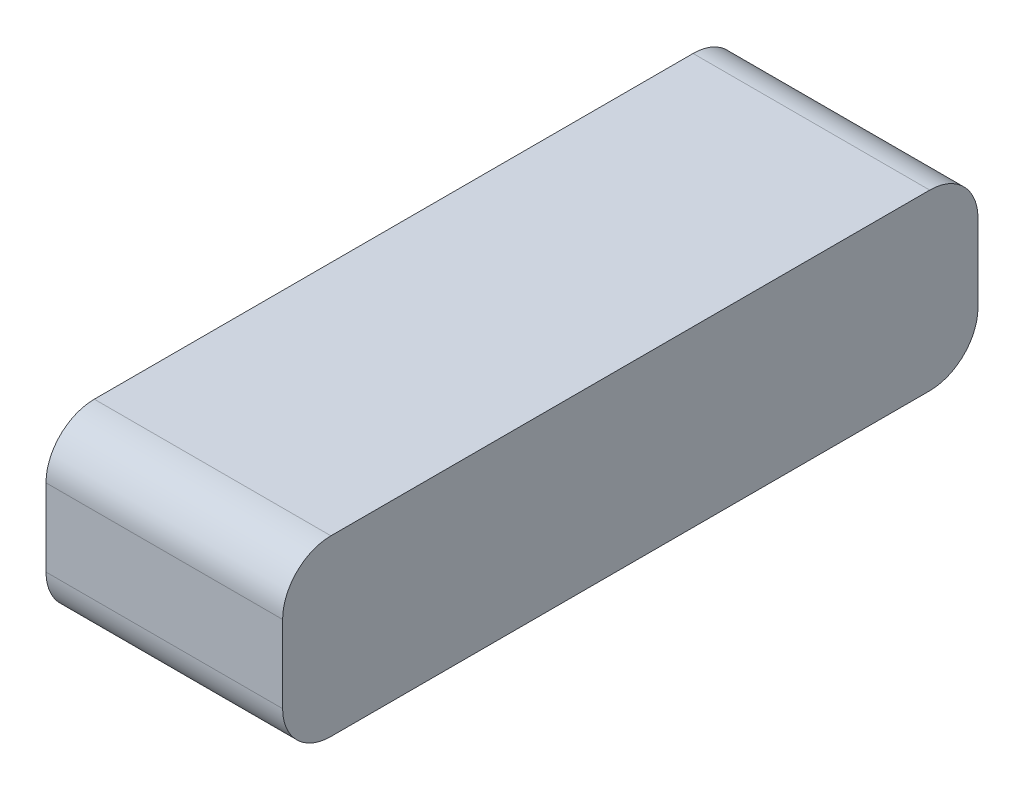
ISO-10303-21;
HEADER;
FILE_DESCRIPTION(('STEP AP214'),'2;1');
FILE_NAME('part.step','',(''),(''),'','','');
FILE_SCHEMA(('AUTOMOTIVE_DESIGN { 1 0 10303 214 1 1 1 1 }'));
ENDSEC;
DATA;
#1=APPLICATION_CONTEXT('core data for automotive mechanical design processes');
#2=APPLICATION_PROTOCOL_DEFINITION('international standard','automotive_design',2000,#1);
#3=PRODUCT_CONTEXT('',#1,'mechanical');
#4=PRODUCT('Part','Part','',(#3));
#5=PRODUCT_RELATED_PRODUCT_CATEGORY('part','',(#4));
#6=PRODUCT_DEFINITION_FORMATION('','',#4);
#7=PRODUCT_DEFINITION_CONTEXT('part definition',#1,'design');
#8=PRODUCT_DEFINITION('design','',#6,#7);
#9=PRODUCT_DEFINITION_SHAPE('','',#8);
#10=(LENGTH_UNIT() NAMED_UNIT(*) SI_UNIT(.MILLI.,.METRE.));
#11=(NAMED_UNIT(*) PLANE_ANGLE_UNIT() SI_UNIT($,.RADIAN.));
#12=(NAMED_UNIT(*) SI_UNIT($,.STERADIAN.) SOLID_ANGLE_UNIT());
#13=UNCERTAINTY_MEASURE_WITH_UNIT(LENGTH_MEASURE(1.E-05),#10,'distance_accuracy_value','');
#14=(GEOMETRIC_REPRESENTATION_CONTEXT(3) GLOBAL_UNCERTAINTY_ASSIGNED_CONTEXT((#13)) GLOBAL_UNIT_ASSIGNED_CONTEXT((#10,
#11,#12)) REPRESENTATION_CONTEXT('',''));
#15=CARTESIAN_POINT('',(0.,0.,0.));
#16=DIRECTION('',(0.,0.,1.));
#17=DIRECTION('',(1.,0.,0.));
#18=AXIS2_PLACEMENT_3D('',#15,#16,#17);
#19=CARTESIAN_POINT('',(24.5,-18.,144.));
#20=DIRECTION('',(-1.,0.,0.));
#21=DIRECTION('',(0.,0.,1.));
#22=AXIS2_PLACEMENT_3D('',#19,#20,#21);
#23=PLANE('',#22);
#24=DIRECTION('',(0.,1.,0.));
#25=VECTOR('',#24,1.);
#26=CARTESIAN_POINT('',(24.5,-18.,0.));
#27=LINE('',#26,#25);
#28=CARTESIAN_POINT('',(24.5,-7.99999999999999,0.));
#29=VERTEX_POINT('',#28);
#30=CARTESIAN_POINT('',(24.5,8.,0.));
#31=VERTEX_POINT('',#30);
#32=EDGE_CURVE('E156',#29,#31,#27,.T.);
#33=ORIENTED_EDGE('',*,*,#32,.T.);
#34=CARTESIAN_POINT('',(24.5,8.,10.));
#35=DIRECTION('',(-1.,0.,0.));
#36=DIRECTION('',(0.,0.,1.));
#37=AXIS2_PLACEMENT_3D('',#34,#35,#36);
#38=CIRCLE('',#37,10.);
#39=CARTESIAN_POINT('',(24.5,18.,10.));
#40=VERTEX_POINT('',#39);
#41=EDGE_CURVE('E141',#31,#40,#38,.F.);
#42=ORIENTED_EDGE('',*,*,#41,.T.);
#43=DIRECTION('',(0.,0.,-1.));
#44=VECTOR('',#43,1.);
#45=CARTESIAN_POINT('',(24.5,18.,144.));
#46=LINE('',#45,#44);
#47=CARTESIAN_POINT('',(24.5,18.,134.));
#48=VERTEX_POINT('',#47);
#49=EDGE_CURVE('E120',#48,#40,#46,.T.);
#50=ORIENTED_EDGE('',*,*,#49,.F.);
#51=CARTESIAN_POINT('',(24.5,8.,134.));
#52=DIRECTION('',(-1.,0.,0.));
#53=DIRECTION('',(0.,0.,1.));
#54=AXIS2_PLACEMENT_3D('',#51,#52,#53);
#55=CIRCLE('',#54,10.);
#56=CARTESIAN_POINT('',(24.5,8.,144.));
#57=VERTEX_POINT('',#56);
#58=EDGE_CURVE('E124',#48,#57,#55,.F.);
#59=ORIENTED_EDGE('',*,*,#58,.T.);
#60=DIRECTION('',(0.,1.,0.));
#61=VECTOR('',#60,1.);
#62=CARTESIAN_POINT('',(24.5,-18.,144.));
#63=LINE('',#62,#61);
#64=CARTESIAN_POINT('',(24.5,-7.99999999999999,144.));
#65=VERTEX_POINT('',#64);
#66=EDGE_CURVE('E150',#65,#57,#63,.T.);
#67=ORIENTED_EDGE('',*,*,#66,.F.);
#68=CARTESIAN_POINT('',(24.5,-7.99999999999999,134.));
#69=DIRECTION('',(-1.,0.,0.));
#70=DIRECTION('',(0.,0.,1.));
#71=AXIS2_PLACEMENT_3D('',#68,#69,#70);
#72=CIRCLE('',#71,10.);
#73=CARTESIAN_POINT('',(24.5,-18.,134.));
#74=VERTEX_POINT('',#73);
#75=EDGE_CURVE('E56',#65,#74,#72,.F.);
#76=ORIENTED_EDGE('',*,*,#75,.T.);
#77=DIRECTION('',(0.,0.,-1.));
#78=VECTOR('',#77,1.);
#79=CARTESIAN_POINT('',(24.5,-18.,144.));
#80=LINE('',#79,#78);
#81=CARTESIAN_POINT('',(24.5,-18.,10.));
#82=VERTEX_POINT('',#81);
#83=EDGE_CURVE('E153',#74,#82,#80,.T.);
#84=ORIENTED_EDGE('',*,*,#83,.T.);
#85=CARTESIAN_POINT('',(24.5,-7.99999999999999,10.));
#86=DIRECTION('',(-1.,0.,0.));
#87=DIRECTION('',(0.,0.,1.));
#88=AXIS2_PLACEMENT_3D('',#85,#86,#87);
#89=CIRCLE('',#88,10.);
#90=EDGE_CURVE('E48',#82,#29,#89,.F.);
#91=ORIENTED_EDGE('',*,*,#90,.T.);
#92=EDGE_LOOP('',(#33,#42,#50,#59,#67,#76,#84,#91));
#93=FACE_BOUND('',#92,.T.);
#94=ADVANCED_FACE('F33',(#93),#23,.F.);
#95=CARTESIAN_POINT('',(-24.5,18.,144.));
#96=DIRECTION('',(0.,-1.,0.));
#97=DIRECTION('',(0.,0.,-1.));
#98=AXIS2_PLACEMENT_3D('',#95,#96,#97);
#99=PLANE('',#98);
#100=ORIENTED_EDGE('',*,*,#49,.T.);
#101=DIRECTION('',(-1.,0.,0.));
#102=VECTOR('',#101,1.);
#103=CARTESIAN_POINT('',(-24.5,18.,10.));
#104=LINE('',#103,#102);
#105=CARTESIAN_POINT('',(-24.5,18.,10.));
#106=VERTEX_POINT('',#105);
#107=EDGE_CURVE('E111',#40,#106,#104,.T.);
#108=ORIENTED_EDGE('',*,*,#107,.T.);
#109=DIRECTION('',(0.,0.,-1.));
#110=VECTOR('',#109,1.);
#111=CARTESIAN_POINT('',(-24.5,18.,144.));
#112=LINE('',#111,#110);
#113=CARTESIAN_POINT('',(-24.5,18.,134.));
#114=VERTEX_POINT('',#113);
#115=EDGE_CURVE('E103',#114,#106,#112,.T.);
#116=ORIENTED_EDGE('',*,*,#115,.F.);
#117=DIRECTION('',(-1.,0.,0.));
#118=VECTOR('',#117,1.);
#119=CARTESIAN_POINT('',(-24.5,18.,134.));
#120=LINE('',#119,#118);
#121=EDGE_CURVE('E117',#114,#48,#120,.F.);
#122=ORIENTED_EDGE('',*,*,#121,.T.);
#123=EDGE_LOOP('',(#100,#108,#116,#122));
#124=FACE_BOUND('',#123,.T.);
#125=ADVANCED_FACE('F116',(#124),#99,.F.);
#126=CARTESIAN_POINT('',(-24.5,-18.,144.));
#127=DIRECTION('',(1.,0.,0.));
#128=DIRECTION('',(0.,0.,-1.));
#129=AXIS2_PLACEMENT_3D('',#126,#127,#128);
#130=PLANE('',#129);
#131=ORIENTED_EDGE('',*,*,#115,.T.);
#132=CARTESIAN_POINT('',(-24.5,8.,10.));
#133=DIRECTION('',(1.,0.,0.));
#134=DIRECTION('',(0.,0.,-1.));
#135=AXIS2_PLACEMENT_3D('',#132,#133,#134);
#136=CIRCLE('',#135,10.);
#137=CARTESIAN_POINT('',(-24.5,8.,0.));
#138=VERTEX_POINT('',#137);
#139=EDGE_CURVE('E132',#106,#138,#136,.F.);
#140=ORIENTED_EDGE('',*,*,#139,.T.);
#141=DIRECTION('',(0.,-1.,0.));
#142=VECTOR('',#141,1.);
#143=CARTESIAN_POINT('',(-24.5,-18.,0.));
#144=LINE('',#143,#142);
#145=CARTESIAN_POINT('',(-24.5,-7.99999999999999,0.));
#146=VERTEX_POINT('',#145);
#147=EDGE_CURVE('E151',#138,#146,#144,.T.);
#148=ORIENTED_EDGE('',*,*,#147,.T.);
#149=CARTESIAN_POINT('',(-24.5,-7.99999999999999,10.));
#150=DIRECTION('',(1.,0.,0.));
#151=DIRECTION('',(0.,0.,-1.));
#152=AXIS2_PLACEMENT_3D('',#149,#150,#151);
#153=CIRCLE('',#152,10.);
#154=CARTESIAN_POINT('',(-24.5,-18.,10.));
#155=VERTEX_POINT('',#154);
#156=EDGE_CURVE('E130',#146,#155,#153,.F.);
#157=ORIENTED_EDGE('',*,*,#156,.T.);
#158=DIRECTION('',(0.,0.,-1.));
#159=VECTOR('',#158,1.);
#160=CARTESIAN_POINT('',(-24.5,-18.,144.));
#161=LINE('',#160,#159);
#162=CARTESIAN_POINT('',(-24.5,-18.,134.));
#163=VERTEX_POINT('',#162);
#164=EDGE_CURVE('E121',#163,#155,#161,.T.);
#165=ORIENTED_EDGE('',*,*,#164,.F.);
#166=CARTESIAN_POINT('',(-24.5,-7.99999999999999,134.));
#167=DIRECTION('',(1.,0.,0.));
#168=DIRECTION('',(0.,0.,-1.));
#169=AXIS2_PLACEMENT_3D('',#166,#167,#168);
#170=CIRCLE('',#169,10.);
#171=CARTESIAN_POINT('',(-24.5,-7.99999999999999,144.));
#172=VERTEX_POINT('',#171);
#173=EDGE_CURVE('E110',#163,#172,#170,.F.);
#174=ORIENTED_EDGE('',*,*,#173,.T.);
#175=DIRECTION('',(0.,-1.,0.));
#176=VECTOR('',#175,1.);
#177=CARTESIAN_POINT('',(-24.5,-18.,144.));
#178=LINE('',#177,#176);
#179=CARTESIAN_POINT('',(-24.5,8.,144.));
#180=VERTEX_POINT('',#179);
#181=EDGE_CURVE('E105',#180,#172,#178,.T.);
#182=ORIENTED_EDGE('',*,*,#181,.F.);
#183=CARTESIAN_POINT('',(-24.5,8.,134.));
#184=DIRECTION('',(1.,0.,0.));
#185=DIRECTION('',(0.,0.,-1.));
#186=AXIS2_PLACEMENT_3D('',#183,#184,#185);
#187=CIRCLE('',#186,10.);
#188=EDGE_CURVE('E100',#180,#114,#187,.F.);
#189=ORIENTED_EDGE('',*,*,#188,.T.);
#190=EDGE_LOOP('',(#131,#140,#148,#157,#165,#174,#182,#189));
#191=FACE_BOUND('',#190,.T.);
#192=ADVANCED_FACE('F102',(#191),#130,.F.);
#193=CARTESIAN_POINT('',(-24.5,-18.,144.));
#194=DIRECTION('',(0.,1.,0.));
#195=DIRECTION('',(0.,0.,1.));
#196=AXIS2_PLACEMENT_3D('',#193,#194,#195);
#197=PLANE('',#196);
#198=ORIENTED_EDGE('',*,*,#164,.T.);
#199=DIRECTION('',(1.,0.,0.));
#200=VECTOR('',#199,1.);
#201=CARTESIAN_POINT('',(24.5,-18.,10.));
#202=LINE('',#201,#200);
#203=EDGE_CURVE('E145',#155,#82,#202,.T.);
#204=ORIENTED_EDGE('',*,*,#203,.T.);
#205=ORIENTED_EDGE('',*,*,#83,.F.);
#206=DIRECTION('',(1.,0.,0.));
#207=VECTOR('',#206,1.);
#208=CARTESIAN_POINT('',(-24.5,-18.,134.));
#209=LINE('',#208,#207);
#210=EDGE_CURVE('E143',#74,#163,#209,.F.);
#211=ORIENTED_EDGE('',*,*,#210,.T.);
#212=EDGE_LOOP('',(#198,#204,#205,#211));
#213=FACE_BOUND('',#212,.T.);
#214=ADVANCED_FACE('F165',(#213),#197,.F.);
#215=CARTESIAN_POINT('',(0.,0.,144.));
#216=DIRECTION('',(0.,0.,-1.));
#217=DIRECTION('',(-1.,0.,0.));
#218=AXIS2_PLACEMENT_3D('',#215,#216,#217);
#219=PLANE('',#218);
#220=ORIENTED_EDGE('',*,*,#181,.T.);
#221=DIRECTION('',(1.,0.,0.));
#222=VECTOR('',#221,1.);
#223=CARTESIAN_POINT('',(0.,-7.99999999999999,144.));
#224=LINE('',#223,#222);
#225=EDGE_CURVE('E11',#172,#65,#224,.T.);
#226=ORIENTED_EDGE('',*,*,#225,.T.);
#227=ORIENTED_EDGE('',*,*,#66,.T.);
#228=DIRECTION('',(-1.,0.,0.));
#229=VECTOR('',#228,1.);
#230=CARTESIAN_POINT('',(0.,8.,144.));
#231=LINE('',#230,#229);
#232=EDGE_CURVE('E41',#57,#180,#231,.T.);
#233=ORIENTED_EDGE('',*,*,#232,.T.);
#234=EDGE_LOOP('',(#220,#226,#227,#233));
#235=FACE_BOUND('',#234,.T.);
#236=ADVANCED_FACE('F148',(#235),#219,.F.);
#237=CARTESIAN_POINT('',(0.,0.,0.));
#238=DIRECTION('',(0.,0.,-1.));
#239=DIRECTION('',(-1.,0.,0.));
#240=AXIS2_PLACEMENT_3D('',#237,#238,#239);
#241=PLANE('',#240);
#242=ORIENTED_EDGE('',*,*,#147,.F.);
#243=DIRECTION('',(-1.,0.,0.));
#244=VECTOR('',#243,1.);
#245=CARTESIAN_POINT('',(24.5,8.,0.));
#246=LINE('',#245,#244);
#247=EDGE_CURVE('E136',#138,#31,#246,.F.);
#248=ORIENTED_EDGE('',*,*,#247,.T.);
#249=ORIENTED_EDGE('',*,*,#32,.F.);
#250=DIRECTION('',(1.,0.,0.));
#251=VECTOR('',#250,1.);
#252=CARTESIAN_POINT('',(-24.5,-7.99999999999999,0.));
#253=LINE('',#252,#251);
#254=EDGE_CURVE('E134',#29,#146,#253,.F.);
#255=ORIENTED_EDGE('',*,*,#254,.T.);
#256=EDGE_LOOP('',(#242,#248,#249,#255));
#257=FACE_BOUND('',#256,.T.);
#258=ADVANCED_FACE('F173',(#257),#241,.T.);
#259=CARTESIAN_POINT('',(-24.5,8.,10.));
#260=DIRECTION('',(1.,0.,0.));
#261=DIRECTION('',(0.,0.,-1.));
#262=AXIS2_PLACEMENT_3D('',#259,#260,#261);
#263=CYLINDRICAL_SURFACE('',#262,10.);
#264=ORIENTED_EDGE('',*,*,#41,.F.);
#265=ORIENTED_EDGE('',*,*,#247,.F.);
#266=ORIENTED_EDGE('',*,*,#139,.F.);
#267=ORIENTED_EDGE('',*,*,#107,.F.);
#268=EDGE_LOOP('',(#264,#265,#266,#267));
#269=FACE_BOUND('',#268,.T.);
#270=ADVANCED_FACE('F177',(#269),#263,.T.);
#271=CARTESIAN_POINT('',(-24.5,-7.99999999999999,10.));
#272=DIRECTION('',(-1.,0.,0.));
#273=DIRECTION('',(0.,0.,1.));
#274=AXIS2_PLACEMENT_3D('',#271,#272,#273);
#275=CYLINDRICAL_SURFACE('',#274,10.);
#276=ORIENTED_EDGE('',*,*,#156,.F.);
#277=ORIENTED_EDGE('',*,*,#254,.F.);
#278=ORIENTED_EDGE('',*,*,#90,.F.);
#279=ORIENTED_EDGE('',*,*,#203,.F.);
#280=EDGE_LOOP('',(#276,#277,#278,#279));
#281=FACE_BOUND('',#280,.T.);
#282=ADVANCED_FACE('F169',(#281),#275,.T.);
#283=CARTESIAN_POINT('',(0.,-7.99999999999999,134.));
#284=DIRECTION('',(1.,0.,0.));
#285=DIRECTION('',(0.,0.,-1.));
#286=AXIS2_PLACEMENT_3D('',#283,#284,#285);
#287=CYLINDRICAL_SURFACE('',#286,10.);
#288=ORIENTED_EDGE('',*,*,#173,.F.);
#289=ORIENTED_EDGE('',*,*,#210,.F.);
#290=ORIENTED_EDGE('',*,*,#75,.F.);
#291=ORIENTED_EDGE('',*,*,#225,.F.);
#292=EDGE_LOOP('',(#288,#289,#290,#291));
#293=FACE_BOUND('',#292,.T.);
#294=ADVANCED_FACE('F179',(#293),#287,.T.);
#295=CARTESIAN_POINT('',(0.,8.,134.));
#296=DIRECTION('',(-1.,0.,0.));
#297=DIRECTION('',(0.,0.,1.));
#298=AXIS2_PLACEMENT_3D('',#295,#296,#297);
#299=CYLINDRICAL_SURFACE('',#298,10.);
#300=ORIENTED_EDGE('',*,*,#58,.F.);
#301=ORIENTED_EDGE('',*,*,#121,.F.);
#302=ORIENTED_EDGE('',*,*,#188,.F.);
#303=ORIENTED_EDGE('',*,*,#232,.F.);
#304=EDGE_LOOP('',(#300,#301,#302,#303));
#305=FACE_BOUND('',#304,.T.);
#306=ADVANCED_FACE('F35',(#305),#299,.T.);
#307=CLOSED_SHELL('',(#94,#125,#192,#214,#236,#258,#270,#282,#294,#306));
#308=MANIFOLD_SOLID_BREP('B2',#307);
#309=ADVANCED_BREP_SHAPE_REPRESENTATION('',(#18,#308),#14);
#310=SHAPE_DEFINITION_REPRESENTATION(#9,#309);
ENDSEC;
END-ISO-10303-21;
